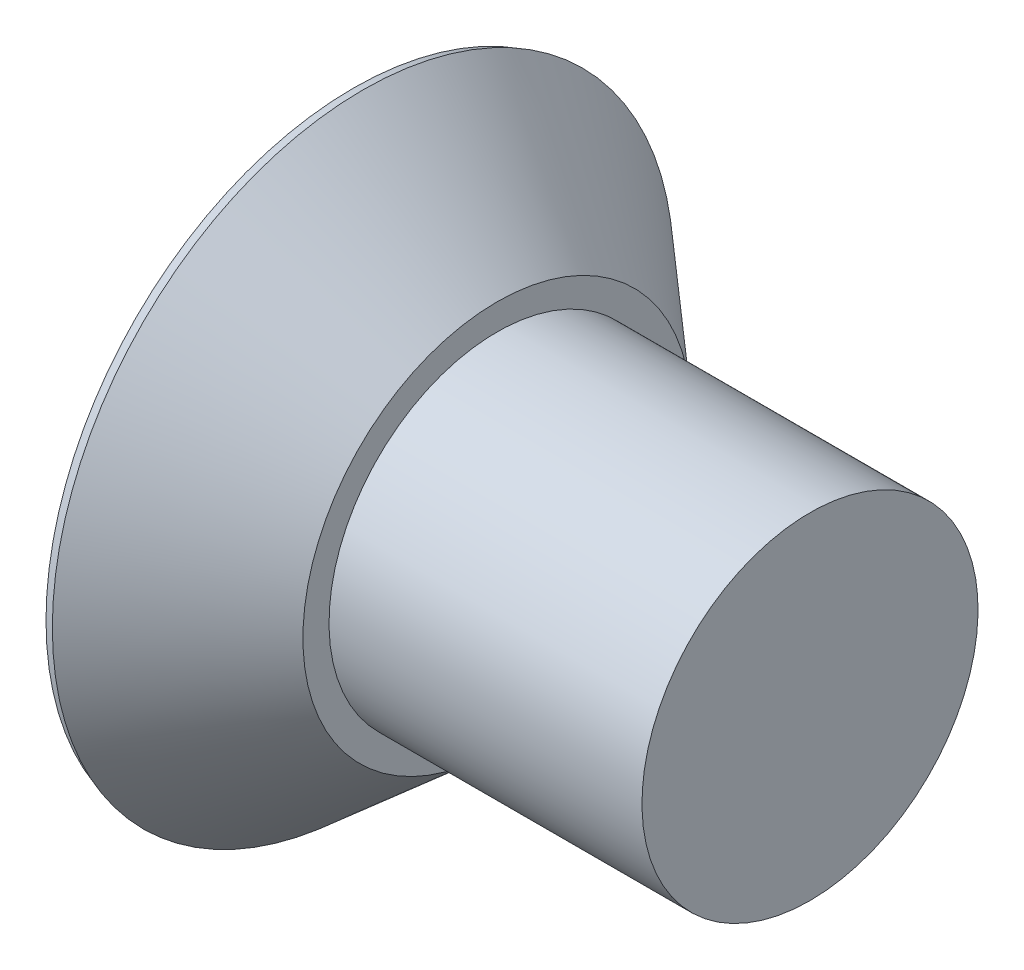
ISO-10303-21;
HEADER;
FILE_DESCRIPTION(('STEP AP214'),'2;1');
FILE_NAME('part.step','',(''),(''),'','','');
FILE_SCHEMA(('AUTOMOTIVE_DESIGN { 1 0 10303 214 1 1 1 1 }'));
ENDSEC;
DATA;
#1=APPLICATION_CONTEXT('core data for automotive mechanical design processes');
#2=APPLICATION_PROTOCOL_DEFINITION('international standard','automotive_design',2000,#1);
#3=PRODUCT_CONTEXT('',#1,'mechanical');
#4=PRODUCT('Part','Part','',(#3));
#5=PRODUCT_RELATED_PRODUCT_CATEGORY('part','',(#4));
#6=PRODUCT_DEFINITION_FORMATION('','',#4);
#7=PRODUCT_DEFINITION_CONTEXT('part definition',#1,'design');
#8=PRODUCT_DEFINITION('design','',#6,#7);
#9=PRODUCT_DEFINITION_SHAPE('','',#8);
#10=(LENGTH_UNIT() NAMED_UNIT(*) SI_UNIT(.MILLI.,.METRE.));
#11=(NAMED_UNIT(*) PLANE_ANGLE_UNIT() SI_UNIT($,.RADIAN.));
#12=(NAMED_UNIT(*) SI_UNIT($,.STERADIAN.) SOLID_ANGLE_UNIT());
#13=UNCERTAINTY_MEASURE_WITH_UNIT(LENGTH_MEASURE(1.E-05),#10,'distance_accuracy_value','');
#14=(GEOMETRIC_REPRESENTATION_CONTEXT(3) GLOBAL_UNCERTAINTY_ASSIGNED_CONTEXT((#13)) GLOBAL_UNIT_ASSIGNED_CONTEXT((#10,
#11,#12)) REPRESENTATION_CONTEXT('',''));
#15=CARTESIAN_POINT('',(0.,0.,0.));
#16=DIRECTION('',(0.,0.,1.));
#17=DIRECTION('',(1.,0.,0.));
#18=AXIS2_PLACEMENT_3D('',#15,#16,#17);
#19=CARTESIAN_POINT('',(-2.38125,0.,0.));
#20=DIRECTION('',(1.,0.,0.));
#21=DIRECTION('',(0.,1.,0.));
#22=AXIS2_PLACEMENT_3D('',#19,#20,#21);
#23=PLANE('',#22);
#24=CARTESIAN_POINT('',(-2.38125,0.,0.));
#25=DIRECTION('',(1.,0.,0.));
#26=DIRECTION('',(0.,1.,0.));
#27=AXIS2_PLACEMENT_3D('',#24,#25,#26);
#28=CIRCLE('',#27,3.20549386286353);
#29=CARTESIAN_POINT('',(-2.38125,3.20549386286353,0.));
#30=VERTEX_POINT('',#29);
#31=EDGE_CURVE('E51',#30,#30,#28,.F.);
#32=ORIENTED_EDGE('',*,*,#31,.T.);
#33=EDGE_LOOP('',(#32));
#34=FACE_BOUND('',#33,.T.);
#35=CARTESIAN_POINT('',(-2.38125,0.,0.));
#36=DIRECTION('',(-1.,0.,0.));
#37=DIRECTION('',(0.,-1.,0.));
#38=AXIS2_PLACEMENT_3D('',#35,#36,#37);
#39=CIRCLE('',#38,1.85778392197704);
#40=CARTESIAN_POINT('',(-2.38125,0.443653333333335,1.80403237791859));
#41=VERTEX_POINT('',#40);
#42=CARTESIAN_POINT('',(-2.38125,-0.443653333333341,1.80403237791859));
#43=VERTEX_POINT('',#42);
#44=EDGE_CURVE('E258',#41,#43,#39,.F.);
#45=ORIENTED_EDGE('',*,*,#44,.T.);
#46=DIRECTION('',(0.,0.,1.));
#47=VECTOR('',#46,1.);
#48=CARTESIAN_POINT('',(-2.38125,-0.443653333333342,2.17344857870313));
#49=LINE('',#48,#47);
#50=CARTESIAN_POINT('',(-2.38125,-0.443653333333339,1.30855095601823));
#51=VERTEX_POINT('',#50);
#52=EDGE_CURVE('E226',#51,#43,#49,.T.);
#53=ORIENTED_EDGE('',*,*,#52,.F.);
#54=DIRECTION('',(0.,0.382683432365087,0.923879532511288));
#55=VECTOR('',#54,1.);
#56=CARTESIAN_POINT('',(-2.38125,-0.443653333333339,1.30855095601823));
#57=LINE('',#56,#55);
#58=CARTESIAN_POINT('',(-2.38125,-0.696975981985619,0.696975981985617));
#59=VERTEX_POINT('',#58);
#60=EDGE_CURVE('E221',#59,#51,#57,.T.);
#61=ORIENTED_EDGE('',*,*,#60,.F.);
#62=DIRECTION('',(0.,0.923879532511285,0.382683432365093));
#63=VECTOR('',#62,1.);
#64=CARTESIAN_POINT('',(-2.38125,-0.696975981985619,0.696975981985617));
#65=LINE('',#64,#63);
#66=CARTESIAN_POINT('',(-2.38125,-1.30855095601823,0.443653333333331));
#67=VERTEX_POINT('',#66);
#68=EDGE_CURVE('E234',#67,#59,#65,.T.);
#69=ORIENTED_EDGE('',*,*,#68,.F.);
#70=DIRECTION('',(0.,1.,0.));
#71=VECTOR('',#70,1.);
#72=CARTESIAN_POINT('',(-2.38125,-1.30855095601823,0.443653333333331));
#73=LINE('',#72,#71);
#74=CARTESIAN_POINT('',(-2.38125,-1.80403237791859,0.44365333333333));
#75=VERTEX_POINT('',#74);
#76=EDGE_CURVE('E230',#75,#67,#73,.T.);
#77=ORIENTED_EDGE('',*,*,#76,.F.);
#78=CARTESIAN_POINT('',(-2.38125,0.,0.));
#79=DIRECTION('',(-1.,0.,0.));
#80=DIRECTION('',(0.,-1.,0.));
#81=AXIS2_PLACEMENT_3D('',#78,#79,#80);
#82=CIRCLE('',#81,1.85778392197704);
#83=CARTESIAN_POINT('',(-2.38125,-1.8040323779186,-0.443653333333334));
#84=VERTEX_POINT('',#83);
#85=EDGE_CURVE('E239',#75,#84,#82,.F.);
#86=ORIENTED_EDGE('',*,*,#85,.T.);
#87=DIRECTION('',(0.,-1.,0.));
#88=VECTOR('',#87,1.);
#89=CARTESIAN_POINT('',(-2.38125,-2.17344857870313,-0.443653333333334));
#90=LINE('',#89,#88);
#91=CARTESIAN_POINT('',(-2.38125,-1.30855095601823,-0.443653333333334));
#92=VERTEX_POINT('',#91);
#93=EDGE_CURVE('E205',#92,#84,#90,.T.);
#94=ORIENTED_EDGE('',*,*,#93,.F.);
#95=DIRECTION('',(0.,-0.923879532511287,0.38268343236509));
#96=VECTOR('',#95,1.);
#97=CARTESIAN_POINT('',(-2.38125,-1.30855095601823,-0.443653333333334));
#98=LINE('',#97,#96);
#99=CARTESIAN_POINT('',(-2.38125,-0.69697598198562,-0.696975981985617));
#100=VERTEX_POINT('',#99);
#101=EDGE_CURVE('E201',#100,#92,#98,.T.);
#102=ORIENTED_EDGE('',*,*,#101,.F.);
#103=DIRECTION('',(0.,-0.38268343236509,0.923879532511287));
#104=VECTOR('',#103,1.);
#105=CARTESIAN_POINT('',(-2.38125,-0.69697598198562,-0.696975981985617));
#106=LINE('',#105,#104);
#107=CARTESIAN_POINT('',(-2.38125,-0.443653333333336,-1.30855095601823));
#108=VERTEX_POINT('',#107);
#109=EDGE_CURVE('E214',#108,#100,#106,.T.);
#110=ORIENTED_EDGE('',*,*,#109,.F.);
#111=DIRECTION('',(0.,0.,1.));
#112=VECTOR('',#111,1.);
#113=CARTESIAN_POINT('',(-2.38125,-0.443653333333336,-1.30855095601823));
#114=LINE('',#113,#112);
#115=CARTESIAN_POINT('',(-2.38125,-0.443653333333336,-1.80403237791859));
#116=VERTEX_POINT('',#115);
#117=EDGE_CURVE('E210',#116,#108,#114,.T.);
#118=ORIENTED_EDGE('',*,*,#117,.F.);
#119=CARTESIAN_POINT('',(-2.38125,0.,0.));
#120=DIRECTION('',(-1.,0.,0.));
#121=DIRECTION('',(0.,-1.,0.));
#122=AXIS2_PLACEMENT_3D('',#119,#120,#121);
#123=CIRCLE('',#122,1.85778392197704);
#124=CARTESIAN_POINT('',(-2.38125,0.443653333333353,-1.80403237791859));
#125=VERTEX_POINT('',#124);
#126=EDGE_CURVE('E191',#116,#125,#123,.F.);
#127=ORIENTED_EDGE('',*,*,#126,.T.);
#128=DIRECTION('',(0.,0.,-1.));
#129=VECTOR('',#128,1.);
#130=CARTESIAN_POINT('',(-2.38125,0.443653333333356,-2.17344857870313));
#131=LINE('',#130,#129);
#132=CARTESIAN_POINT('',(-2.38125,0.443653333333347,-1.30855095601823));
#133=VERTEX_POINT('',#132);
#134=EDGE_CURVE('E170',#133,#125,#131,.T.);
#135=ORIENTED_EDGE('',*,*,#134,.F.);
#136=DIRECTION('',(0.,-0.38268343236508,-0.923879532511291));
#137=VECTOR('',#136,1.);
#138=CARTESIAN_POINT('',(-2.38125,0.443653333333347,-1.30855095601823));
#139=LINE('',#138,#137);
#140=CARTESIAN_POINT('',(-2.38125,0.696975981985623,-0.696975981985612));
#141=VERTEX_POINT('',#140);
#142=EDGE_CURVE('E180',#141,#133,#139,.T.);
#143=ORIENTED_EDGE('',*,*,#142,.F.);
#144=DIRECTION('',(0.,-0.923879532511283,-0.3826834323651));
#145=VECTOR('',#144,1.);
#146=CARTESIAN_POINT('',(-2.38125,0.696975981985623,-0.696975981985612));
#147=LINE('',#146,#145);
#148=CARTESIAN_POINT('',(-2.38125,1.30855095601824,-0.443653333333322));
#149=VERTEX_POINT('',#148);
#150=EDGE_CURVE('E177',#149,#141,#147,.T.);
#151=ORIENTED_EDGE('',*,*,#150,.F.);
#152=DIRECTION('',(0.,-1.,0.));
#153=VECTOR('',#152,1.);
#154=CARTESIAN_POINT('',(-2.38125,1.30855095601824,-0.443653333333322));
#155=LINE('',#154,#153);
#156=CARTESIAN_POINT('',(-2.38125,1.8040323779186,-0.443653333333317));
#157=VERTEX_POINT('',#156);
#158=EDGE_CURVE('E193',#157,#149,#155,.T.);
#159=ORIENTED_EDGE('',*,*,#158,.F.);
#160=CARTESIAN_POINT('',(-2.38125,1.80403237791859,0.443653333333334));
#161=VERTEX_POINT('',#160);
#162=EDGE_CURVE('E262',#157,#161,#39,.F.);
#163=ORIENTED_EDGE('',*,*,#162,.T.);
#164=DIRECTION('',(0.,1.,0.));
#165=VECTOR('',#164,1.);
#166=CARTESIAN_POINT('',(-2.38125,2.17344857870313,0.443653333333334));
#167=LINE('',#166,#165);
#168=CARTESIAN_POINT('',(-2.38125,1.30855095601823,0.443653333333334));
#169=VERTEX_POINT('',#168);
#170=EDGE_CURVE('E59',#169,#161,#167,.T.);
#171=ORIENTED_EDGE('',*,*,#170,.F.);
#172=DIRECTION('',(0.,0.923879532511287,-0.38268343236509));
#173=VECTOR('',#172,1.);
#174=CARTESIAN_POINT('',(-2.38125,1.30855095601823,0.443653333333334));
#175=LINE('',#174,#173);
#176=CARTESIAN_POINT('',(-2.38125,0.696975981985619,0.696975981985617));
#177=VERTEX_POINT('',#176);
#178=EDGE_CURVE('E243',#177,#169,#175,.T.);
#179=ORIENTED_EDGE('',*,*,#178,.F.);
#180=DIRECTION('',(0.,0.38268343236509,-0.923879532511287));
#181=VECTOR('',#180,1.);
#182=CARTESIAN_POINT('',(-2.38125,0.696975981985619,0.696975981985617));
#183=LINE('',#182,#181);
#184=CARTESIAN_POINT('',(-2.38125,0.443653333333335,1.30855095601823));
#185=VERTEX_POINT('',#184);
#186=EDGE_CURVE('E253',#185,#177,#183,.T.);
#187=ORIENTED_EDGE('',*,*,#186,.F.);
#188=DIRECTION('',(0.,0.,-1.));
#189=VECTOR('',#188,1.);
#190=CARTESIAN_POINT('',(-2.38125,0.443653333333335,1.30855095601823));
#191=LINE('',#190,#189);
#192=EDGE_CURVE('E250',#41,#185,#191,.T.);
#193=ORIENTED_EDGE('',*,*,#192,.F.);
#194=EDGE_LOOP('',(#45,#53,#61,#69,#77,#86,#94,#102,#110,#118,#127,#135,#143,#151,#159,#163,
#171,#179,#187,#193));
#195=FACE_BOUND('',#194,.T.);
#196=ADVANCED_FACE('F41',(#34,#195),#23,.F.);
#197=CARTESIAN_POINT('',(2.38125,0.,0.));
#198=DIRECTION('',(-1.,0.,0.));
#199=DIRECTION('',(0.,-1.,0.));
#200=AXIS2_PLACEMENT_3D('',#197,#198,#199);
#201=PLANE('',#200);
#202=CARTESIAN_POINT('',(2.38125,0.,0.));
#203=DIRECTION('',(-1.,0.,0.));
#204=DIRECTION('',(0.,-1.,0.));
#205=AXIS2_PLACEMENT_3D('',#202,#203,#204);
#206=CIRCLE('',#205,1.7526);
#207=CARTESIAN_POINT('',(2.38125,-1.7526,0.));
#208=VERTEX_POINT('',#207);
#209=EDGE_CURVE('E270',#208,#208,#206,.T.);
#210=ORIENTED_EDGE('',*,*,#209,.F.);
#211=EDGE_LOOP('',(#210));
#212=FACE_BOUND('',#211,.T.);
#213=ADVANCED_FACE('F427',(#212),#201,.F.);
#214=CARTESIAN_POINT('',(-2.38125,0.,0.));
#215=DIRECTION('',(-1.,0.,0.));
#216=DIRECTION('',(0.,-1.,0.));
#217=AXIS2_PLACEMENT_3D('',#214,#215,#216);
#218=CYLINDRICAL_SURFACE('',#217,1.7526);
#219=CARTESIAN_POINT('',(-0.88265,0.,0.));
#220=DIRECTION('',(-1.,0.,0.));
#221=DIRECTION('',(0.,-1.,0.));
#222=AXIS2_PLACEMENT_3D('',#219,#220,#221);
#223=CIRCLE('',#222,1.7526);
#224=CARTESIAN_POINT('',(-0.88265,-1.7526,0.));
#225=VERTEX_POINT('',#224);
#226=EDGE_CURVE('E266',#225,#225,#223,.T.);
#227=ORIENTED_EDGE('',*,*,#226,.F.);
#228=EDGE_LOOP('',(#227));
#229=FACE_BOUND('',#228,.T.);
#230=ORIENTED_EDGE('',*,*,#209,.T.);
#231=EDGE_LOOP('',(#230));
#232=FACE_BOUND('',#231,.T.);
#233=ADVANCED_FACE('F432',(#229,#232),#218,.T.);
#234=CARTESIAN_POINT('',(-0.88265,1.7526,0.));
#235=DIRECTION('',(-1.,0.,0.));
#236=DIRECTION('',(0.,-1.,0.));
#237=AXIS2_PLACEMENT_3D('',#234,#235,#236);
#238=PLANE('',#237);
#239=CARTESIAN_POINT('',(-0.88265,0.,0.));
#240=DIRECTION('',(-1.,0.,0.));
#241=DIRECTION('',(0.,-1.,0.));
#242=AXIS2_PLACEMENT_3D('',#239,#240,#241);
#243=CIRCLE('',#242,2.0246868947086);
#244=CARTESIAN_POINT('',(-0.882649999999999,-2.0246868947086,0.));
#245=VERTEX_POINT('',#244);
#246=EDGE_CURVE('E261',#245,#245,#243,.T.);
#247=ORIENTED_EDGE('',*,*,#246,.F.);
#248=EDGE_LOOP('',(#247));
#249=FACE_BOUND('',#248,.T.);
#250=ORIENTED_EDGE('',*,*,#226,.T.);
#251=EDGE_LOOP('',(#250));
#252=FACE_BOUND('',#251,.T.);
#253=ADVANCED_FACE('F438',(#249,#252),#238,.F.);
#254=CARTESIAN_POINT('',(-0.88265,0.,0.));
#255=DIRECTION('',(-1.,0.,0.));
#256=DIRECTION('',(0.,-1.,0.));
#257=AXIS2_PLACEMENT_3D('',#254,#255,#256);
#258=CONICAL_SURFACE('',#257,2.0246868947086,0.715584993317677);
#259=CARTESIAN_POINT('',(-2.28080117371067,0.,0.));
#260=DIRECTION('',(1.,0.,0.));
#261=DIRECTION('',(0.,1.,0.));
#262=AXIS2_PLACEMENT_3D('',#259,#260,#261);
#263=CIRCLE('',#262,3.24008116747748);
#264=CARTESIAN_POINT('',(-2.28080117371067,3.24008116747748,0.));
#265=VERTEX_POINT('',#264);
#266=EDGE_CURVE('E12',#265,#265,#263,.T.);
#267=ORIENTED_EDGE('',*,*,#266,.T.);
#268=EDGE_LOOP('',(#267));
#269=FACE_BOUND('',#268,.T.);
#270=ORIENTED_EDGE('',*,*,#246,.T.);
#271=EDGE_LOOP('',(#270));
#272=FACE_BOUND('',#271,.T.);
#273=ADVANCED_FACE('F302',(#269,#272),#258,.T.);
#274=CARTESIAN_POINT('',(-2.38125,2.17344857870313,0.443653333333334));
#275=DIRECTION('',(-0.0871557427476584,0.,-0.996194698091745));
#276=DIRECTION('',(-0.996194698091746,0.,0.0871557427476584));
#277=AXIS2_PLACEMENT_3D('',#274,#275,#276);
#278=PLANE('',#277);
#279=CARTESIAN_POINT('',(-2.38125,1.80403237791859,0.443653333333334));
#280=CARTESIAN_POINT('',(-2.33313916956716,1.7619985798292,0.439444181077642));
#281=CARTESIAN_POINT('',(-2.28504214926996,1.7199488396603,0.435236237052261));
#282=CARTESIAN_POINT('',(-2.18888443628984,1.63580765051655,0.426823527255921));
#283=CARTESIAN_POINT('',(-2.14082374356158,1.5937162015939,0.422618761480996));
#284=CARTESIAN_POINT('',(-2.04474724700092,1.5094816426922,0.41421315720065));
#285=CARTESIAN_POINT('',(-1.99673144319259,1.46733853268545,0.410012318697336));
#286=CARTESIAN_POINT('',(-1.90075889584453,1.38298448864911,0.401615808794676));
#287=CARTESIAN_POINT('',(-1.85280215237926,1.34077355453414,0.397420137401845));
#288=CARTESIAN_POINT('',(-1.80488207237906,1.29852066867325,0.393227673646571));
#289=B_SPLINE_CURVE_WITH_KNOTS('',3,(#279,#280,#281,#282,#283,#284,#285,#286,#287,#288),
.UNSPECIFIED.,.F.,.F.,(4,2,2,2,4),(0.,0.192075209228686,0.384150178394845,0.576225250546724,
0.768300564644841),.UNSPECIFIED.);
#290=CARTESIAN_POINT('',(-1.80488207237904,1.29852066867326,0.39322767364657));
#291=VERTEX_POINT('',#290);
#292=EDGE_CURVE('E109',#161,#291,#289,.T.);
#293=ORIENTED_EDGE('',*,*,#292,.T.);
#294=DIRECTION('',(-0.996045029063886,0.0173337504938601,0.0871426484044397));
#295=VECTOR('',#294,1.);
#296=CARTESIAN_POINT('',(-2.39618262698808,1.30881082221191,0.444959768911452));
#297=LINE('',#296,#295);
#298=EDGE_CURVE('E257',#291,#169,#297,.T.);
#299=ORIENTED_EDGE('',*,*,#298,.T.);
#300=ORIENTED_EDGE('',*,*,#170,.T.);
#301=EDGE_LOOP('',(#293,#299,#300));
#302=FACE_BOUND('',#301,.T.);
#303=ADVANCED_FACE('F445',(#302),#278,.T.);
#304=CARTESIAN_POINT('',(-2.38125,0.443653333333335,1.30855095601823));
#305=DIRECTION('',(-0.0871557427476582,-0.996194698091745,0.));
#306=DIRECTION('',(0.996194698091746,-0.0871557427476582,0.));
#307=AXIS2_PLACEMENT_3D('',#304,#305,#306);
#308=PLANE('',#307);
#309=CARTESIAN_POINT('',(-1.80488207237904,0.393227673646572,1.29852066867326));
#310=CARTESIAN_POINT('',(-1.85280215237926,0.397420137401846,1.34077355453414));
#311=CARTESIAN_POINT('',(-1.90075889584452,0.401615808794677,1.38298448864911));
#312=CARTESIAN_POINT('',(-1.99673144319259,0.410012318697338,1.46733853268545));
#313=CARTESIAN_POINT('',(-2.04474724700092,0.414213157200652,1.5094816426922));
#314=CARTESIAN_POINT('',(-2.14082374356158,0.422618761480997,1.5937162015939));
#315=CARTESIAN_POINT('',(-2.18888443628984,0.426823527255922,1.63580765051655));
#316=CARTESIAN_POINT('',(-2.28504214926996,0.435236237052263,1.7199488396603));
#317=CARTESIAN_POINT('',(-2.33313916956716,0.439444181077644,1.7619985798292));
#318=CARTESIAN_POINT('',(-2.38125,0.443653333333335,1.80403237791859));
#319=B_SPLINE_CURVE_WITH_KNOTS('',3,(#309,#310,#311,#312,#313,#314,#315,#316,#317,#318),
.UNSPECIFIED.,.F.,.F.,(4,2,2,2,4),(0.,0.192075314098117,0.384150386249995,0.576225355416153,
0.76830056464484),.UNSPECIFIED.);
#320=CARTESIAN_POINT('',(-1.80488207237904,0.393227673646572,1.29852066867326));
#321=VERTEX_POINT('',#320);
#322=EDGE_CURVE('E116',#321,#41,#319,.T.);
#323=ORIENTED_EDGE('',*,*,#322,.T.);
#324=ORIENTED_EDGE('',*,*,#192,.T.);
#325=DIRECTION('',(-0.996045029063886,0.0871426484044395,0.0173337504938603));
#326=VECTOR('',#325,1.);
#327=CARTESIAN_POINT('',(-2.39267893790005,0.444653235835732,1.30874984899213));
#328=LINE('',#327,#326);
#329=EDGE_CURVE('E470',#321,#185,#328,.T.);
#330=ORIENTED_EDGE('',*,*,#329,.F.);
#331=EDGE_LOOP('',(#323,#324,#330));
#332=FACE_BOUND('',#331,.T.);
#333=ADVANCED_FACE('F419',(#332),#308,.T.);
#334=CARTESIAN_POINT('',(-2.38125,0.696975981985619,0.696975981985617));
#335=DIRECTION('',(-0.0871557427476582,-0.920363891963224,-0.381227206369654));
#336=DIRECTION('',(0.,0.38268343236509,-0.923879532511287));
#337=AXIS2_PLACEMENT_3D('',#334,#335,#336);
#338=PLANE('',#337);
#339=CARTESIAN_POINT('',(-1.25534935097126,0.621584634079309,0.621584634079307));
#340=CARTESIAN_POINT('',(-1.26864027946566,0.612197965955895,0.647284612957172));
#341=CARTESIAN_POINT('',(-1.28295666683925,0.603099671025228,0.672522836638136));
#342=CARTESIAN_POINT('',(-1.31319848549949,0.585406530250408,0.722151708229198));
#343=CARTESIAN_POINT('',(-1.32912163779573,0.576810997911969,0.746543492462847));
#344=CARTESIAN_POINT('',(-1.36211628152607,0.560053947740962,0.794541789248833));
#345=CARTESIAN_POINT('',(-1.37918351831562,0.551891004178205,0.818150771126196));
#346=CARTESIAN_POINT('',(-1.4142535356775,0.535893319850772,0.864790266220632));
#347=CARTESIAN_POINT('',(-1.43225668656817,0.528058711249064,0.887820545029844));
#348=CARTESIAN_POINT('',(-1.48712795244717,0.505050272578142,0.955912437902741));
#349=CARTESIAN_POINT('',(-1.525055612449,0.490275615307991,1.00025259559162));
#350=CARTESIAN_POINT('',(-1.60273336824755,0.461453442775634,1.08759407813004));
#351=CARTESIAN_POINT('',(-1.6424849129971,0.447406525195917,1.13059429130442));
#352=CARTESIAN_POINT('',(-1.70290200004715,0.426777152333373,1.19421049074616));
#353=CARTESIAN_POINT('',(-1.72310646147017,0.419995294273181,1.21520246610219));
#354=CARTESIAN_POINT('',(-1.76379905628938,0.406535553796763,1.25700025017755));
#355=CARTESIAN_POINT('',(-1.78428752785224,0.399857819876078,1.27780577770821));
#356=CARTESIAN_POINT('',(-1.80488207237905,0.393227673646574,1.29852066867325));
#357=B_SPLINE_CURVE_WITH_KNOTS('',3,(#339,#340,#341,#342,#343,#344,#345,#346,#347,#348,#349,
#350,#351,#352,#353,#354,#355,#356),.UNSPECIFIED.,.F.,.F.,(4,2,2,2,2,2,2,2,4),(0.,
0.0911869021173685,0.182246238297853,0.272983947920126,0.363757837626611,0.544245502786659,
0.724879123559479,0.814620849754082,0.904480615943712),.UNSPECIFIED.);
#358=CARTESIAN_POINT('',(-1.25534935097126,0.621584634079309,0.621584634079307));
#359=VERTEX_POINT('',#358);
#360=EDGE_CURVE('E405',#359,#321,#357,.T.);
#361=ORIENTED_EDGE('',*,*,#360,.T.);
#362=ORIENTED_EDGE('',*,*,#329,.T.);
#363=ORIENTED_EDGE('',*,*,#186,.T.);
#364=DIRECTION('',(-0.995546167269401,0.0666626913468322,0.0666626913468324));
#365=VECTOR('',#364,1.);
#366=CARTESIAN_POINT('',(-2.40502569747195,0.698568024659516,0.698568024659514));
#367=LINE('',#366,#365);
#368=EDGE_CURVE('E468',#359,#177,#367,.T.);
#369=ORIENTED_EDGE('',*,*,#368,.F.);
#370=EDGE_LOOP('',(#361,#362,#363,#369));
#371=FACE_BOUND('',#370,.T.);
#372=ADVANCED_FACE('F416',(#371),#338,.T.);
#373=CARTESIAN_POINT('',(-2.38125,1.30855095601823,0.443653333333334));
#374=DIRECTION('',(-0.0871557427476583,-0.381227206369654,-0.920363891963224));
#375=DIRECTION('',(0.,0.923879532511287,-0.38268343236509));
#376=AXIS2_PLACEMENT_3D('',#373,#374,#375);
#377=PLANE('',#376);
#378=CARTESIAN_POINT('',(-1.80488207237904,1.29852066867326,0.39322767364657));
#379=CARTESIAN_POINT('',(-1.77895667255378,1.27244326082035,0.401574230844656));
#380=CARTESIAN_POINT('',(-1.75320017097531,1.24622416392674,0.409995471730261));
#381=CARTESIAN_POINT('',(-1.70211577912161,1.19343325829183,0.427024639757123));
#382=CARTESIAN_POINT('',(-1.67678787788688,1.16686145860041,0.435632562111966));
#383=CARTESIAN_POINT('',(-1.60182530143728,1.08677168051612,0.461708099775561));
#384=CARTESIAN_POINT('',(-1.55295769922927,1.03262686229013,0.479508000193212));
#385=CARTESIAN_POINT('',(-1.48218293428302,0.949415182976467,0.507273245069221));
#386=CARTESIAN_POINT('',(-1.45897093161794,0.92129041858178,0.516724795812373));
#387=CARTESIAN_POINT('',(-1.4137548162684,0.864257040033871,0.536066962113809));
#388=CARTESIAN_POINT('',(-1.39174999556238,0.835348900528016,0.545957314019165));
#389=CARTESIAN_POINT('',(-1.34924989088138,0.776397684482621,0.566351072812457));
#390=CARTESIAN_POINT('',(-1.328762484902,0.746349764101839,0.576857232108051));
#391=CARTESIAN_POINT('',(-1.29011103816214,0.684971498363006,0.598620764342913));
#392=CARTESIAN_POINT('',(-1.27195192778003,0.653638611167803,0.609879657037876));
#393=CARTESIAN_POINT('',(-1.25534935097069,0.621584634079796,0.621584634079051));
#394=B_SPLINE_CURVE_WITH_KNOTS('',3,(#378,#379,#380,#381,#382,#383,#384,#385,#386,#387,#388,
#389,#390,#391,#392,#393),.UNSPECIFIED.,.F.,.F.,(4,2,2,2,2,2,2,4),(0.,0.113116282910397,
0.226229669000348,0.45135551516347,0.564346939613073,0.67727136921621,0.790746046408614,
0.904457181617426),.UNSPECIFIED.);
#395=EDGE_CURVE('E106',#291,#359,#394,.T.);
#396=ORIENTED_EDGE('',*,*,#395,.T.);
#397=ORIENTED_EDGE('',*,*,#368,.T.);
#398=ORIENTED_EDGE('',*,*,#178,.T.);
#399=ORIENTED_EDGE('',*,*,#298,.F.);
#400=EDGE_LOOP('',(#396,#397,#398,#399));
#401=FACE_BOUND('',#400,.T.);
#402=ADVANCED_FACE('F300',(#401),#377,.T.);
#403=CARTESIAN_POINT('',(-1.61030693768768,0.,0.));
#404=DIRECTION('',(-1.,0.,0.));
#405=DIRECTION('',(0.,-1.,0.));
#406=AXIS2_PLACEMENT_3D('',#403,#404,#405);
#407=CONICAL_SURFACE('',#406,1.18761334229751,0.715584993317677);
#408=CARTESIAN_POINT('',(-0.24411406871448,0.,0.));
#409=VERTEX_POINT('',#408);
#410=VERTEX_LOOP('',#409);
#411=FACE_BOUND('',#410,.T.);
#412=ORIENTED_EDGE('',*,*,#162,.F.);
#413=CARTESIAN_POINT('',(-1.80488207237904,1.29852066867326,-0.393227673646558));
#414=CARTESIAN_POINT('',(-1.85280215237926,1.34077355453414,-0.397420137401832));
#415=CARTESIAN_POINT('',(-1.90075889584453,1.38298448864911,-0.401615808794663));
#416=CARTESIAN_POINT('',(-1.99673144319259,1.46733853268546,-0.410012318697323));
#417=CARTESIAN_POINT('',(-2.04474724700092,1.5094816426922,-0.414213157200636));
#418=CARTESIAN_POINT('',(-2.14082374356158,1.5937162015939,-0.422618761480981));
#419=CARTESIAN_POINT('',(-2.18888443628984,1.63580765051655,-0.426823527255906));
#420=CARTESIAN_POINT('',(-2.28504214926996,1.7199488396603,-0.435236237052245));
#421=CARTESIAN_POINT('',(-2.33313916956716,1.7619985798292,-0.439444181077626));
#422=CARTESIAN_POINT('',(-2.38125,1.8040323779186,-0.443653333333317));
#423=B_SPLINE_CURVE_WITH_KNOTS('',3,(#413,#414,#415,#416,#417,#418,#419,#420,#421,#422),
.UNSPECIFIED.,.F.,.F.,(4,2,2,2,4),(0.,0.192075314098117,0.384150386249995,0.576225355416154,
0.768300564644841),.UNSPECIFIED.);
#424=CARTESIAN_POINT('',(-1.80488207237904,1.29852066867326,-0.393227673646558));
#425=VERTEX_POINT('',#424);
#426=EDGE_CURVE('E286',#425,#157,#423,.T.);
#427=ORIENTED_EDGE('',*,*,#426,.F.);
#428=CARTESIAN_POINT('',(-1.25534935097126,0.621584634079313,-0.621584634079303));
#429=CARTESIAN_POINT('',(-1.26864027946566,0.647284612957178,-0.612197965955888));
#430=CARTESIAN_POINT('',(-1.28295666683925,0.672522836638142,-0.603099671025221));
#431=CARTESIAN_POINT('',(-1.31319848549949,0.722151708229204,-0.585406530250401));
#432=CARTESIAN_POINT('',(-1.32912163779573,0.746543492462853,-0.576810997911961));
#433=CARTESIAN_POINT('',(-1.36211628152607,0.794541789248839,-0.560053947740954));
#434=CARTESIAN_POINT('',(-1.37918351831562,0.818150771126202,-0.551891004178196));
#435=CARTESIAN_POINT('',(-1.4142535356775,0.864790266220637,-0.535893319850764));
#436=CARTESIAN_POINT('',(-1.43225668656817,0.88782054502985,-0.528058711249055));
#437=CARTESIAN_POINT('',(-1.48712795244717,0.955912437902745,-0.505050272578132));
#438=CARTESIAN_POINT('',(-1.525055612449,1.00025259559162,-0.49027561530798));
#439=CARTESIAN_POINT('',(-1.60273336824755,1.08759407813005,-0.461453442775623));
#440=CARTESIAN_POINT('',(-1.6424849129971,1.13059429130443,-0.447406525195906));
#441=CARTESIAN_POINT('',(-1.70290200004715,1.19421049074617,-0.42677715233336));
#442=CARTESIAN_POINT('',(-1.72310646147017,1.2152024661022,-0.419995294273169));
#443=CARTESIAN_POINT('',(-1.76379905628938,1.25700025017755,-0.40653555379675));
#444=CARTESIAN_POINT('',(-1.78428752785224,1.27780577770822,-0.399857819876065));
#445=CARTESIAN_POINT('',(-1.80488207237905,1.29852066867326,-0.393227673646561));
#446=B_SPLINE_CURVE_WITH_KNOTS('',3,(#428,#429,#430,#431,#432,#433,#434,#435,#436,#437,#438,
#439,#440,#441,#442,#443,#444,#445),.UNSPECIFIED.,.F.,.F.,(4,2,2,2,2,2,2,2,4),(0.,
0.0911869021173685,0.182246238297853,0.272983947920126,0.363757837626611,0.544245502786659,
0.724879123559478,0.814620849754081,0.904480615943712),.UNSPECIFIED.);
#447=CARTESIAN_POINT('',(-1.25534935097126,0.621584634079313,-0.621584634079303));
#448=VERTEX_POINT('',#447);
#449=EDGE_CURVE('E319',#448,#425,#446,.T.);
#450=ORIENTED_EDGE('',*,*,#449,.F.);
#451=CARTESIAN_POINT('',(-1.80488207237905,0.393227673646583,-1.29852066867325));
#452=CARTESIAN_POINT('',(-1.77895667255379,0.401574230844669,-1.27244326082035));
#453=CARTESIAN_POINT('',(-1.75320017097531,0.409995471730274,-1.24622416392673));
#454=CARTESIAN_POINT('',(-1.70211577912161,0.427024639757135,-1.19343325829183));
#455=CARTESIAN_POINT('',(-1.67678787788688,0.435632562111978,-1.16686145860041));
#456=CARTESIAN_POINT('',(-1.60182530143728,0.461708099775572,-1.08677168051611));
#457=CARTESIAN_POINT('',(-1.55295769922927,0.479508000193223,-1.03262686229013));
#458=CARTESIAN_POINT('',(-1.48218293428302,0.50727324506923,-0.949415182976463));
#459=CARTESIAN_POINT('',(-1.45897093161794,0.516724795812383,-0.921290418581775));
#460=CARTESIAN_POINT('',(-1.4137548162684,0.536066962113817,-0.864257040033866));
#461=CARTESIAN_POINT('',(-1.39174999556238,0.545957314019174,-0.835348900528011));
#462=CARTESIAN_POINT('',(-1.34924989088138,0.566351072812465,-0.776397684482615));
#463=CARTESIAN_POINT('',(-1.328762484902,0.576857232108059,-0.746349764101833));
#464=CARTESIAN_POINT('',(-1.29011103816214,0.598620764342921,-0.684971498363));
#465=CARTESIAN_POINT('',(-1.27195192778003,0.609879657037883,-0.653638611167797));
#466=CARTESIAN_POINT('',(-1.25534935097069,0.621584634079057,-0.62158463407979));
#467=B_SPLINE_CURVE_WITH_KNOTS('',3,(#451,#452,#453,#454,#455,#456,#457,#458,#459,#460,#461,
#462,#463,#464,#465,#466),.UNSPECIFIED.,.F.,.F.,(4,2,2,2,2,2,2,4),(0.,0.113116282910397,
0.226229669000348,0.45135551516347,0.564346939613073,0.677271369216211,0.790746046408615,
0.904457181617427),.UNSPECIFIED.);
#468=CARTESIAN_POINT('',(-1.80488207237905,0.393227673646583,-1.29852066867325));
#469=VERTEX_POINT('',#468);
#470=EDGE_CURVE('E206',#469,#448,#467,.T.);
#471=ORIENTED_EDGE('',*,*,#470,.F.);
#472=CARTESIAN_POINT('',(-2.38125,0.443653333333353,-1.80403237791859));
#473=CARTESIAN_POINT('',(-2.33313916956716,0.439444181077661,-1.7619985798292));
#474=CARTESIAN_POINT('',(-2.28504214926997,0.435236237052279,-1.71994883966029));
#475=CARTESIAN_POINT('',(-2.18888443628984,0.426823527255938,-1.63580765051655));
#476=CARTESIAN_POINT('',(-2.14082374356159,0.422618761481012,-1.5937162015939));
#477=CARTESIAN_POINT('',(-2.04474724700092,0.414213157200666,-1.50948164269219));
#478=CARTESIAN_POINT('',(-1.99673144319259,0.410012318697351,-1.46733853268545));
#479=CARTESIAN_POINT('',(-1.90075889584453,0.40161580879469,-1.3829844886491));
#480=CARTESIAN_POINT('',(-1.85280215237926,0.397420137401858,-1.34077355453413));
#481=CARTESIAN_POINT('',(-1.80488207237906,0.393227673646584,-1.29852066867324));
#482=B_SPLINE_CURVE_WITH_KNOTS('',3,(#472,#473,#474,#475,#476,#477,#478,#479,#480,#481),
.UNSPECIFIED.,.F.,.F.,(4,2,2,2,4),(0.,0.192075209228687,0.384150178394845,0.576225250546724,
0.768300564644841),.UNSPECIFIED.);
#483=EDGE_CURVE('E172',#125,#469,#482,.T.);
#484=ORIENTED_EDGE('',*,*,#483,.F.);
#485=ORIENTED_EDGE('',*,*,#126,.F.);
#486=CARTESIAN_POINT('',(-1.80488207237904,-0.393227673646572,-1.29852066867326));
#487=CARTESIAN_POINT('',(-1.85280215237926,-0.397420137401846,-1.34077355453414));
#488=CARTESIAN_POINT('',(-1.90075889584452,-0.401615808794678,-1.38298448864911));
#489=CARTESIAN_POINT('',(-1.99673144319259,-0.410012318697339,-1.46733853268545));
#490=CARTESIAN_POINT('',(-2.04474724700092,-0.414213157200652,-1.5094816426922));
#491=CARTESIAN_POINT('',(-2.14082374356158,-0.422618761480998,-1.5937162015939));
#492=CARTESIAN_POINT('',(-2.18888443628984,-0.426823527255923,-1.63580765051655));
#493=CARTESIAN_POINT('',(-2.28504214926996,-0.435236237052264,-1.7199488396603));
#494=CARTESIAN_POINT('',(-2.33313916956716,-0.439444181077645,-1.7619985798292));
#495=CARTESIAN_POINT('',(-2.38125,-0.443653333333336,-1.80403237791859));
#496=B_SPLINE_CURVE_WITH_KNOTS('',3,(#486,#487,#488,#489,#490,#491,#492,#493,#494,#495),
.UNSPECIFIED.,.F.,.F.,(4,2,2,2,4),(0.,0.192075314098117,0.384150386249995,0.576225355416153,
0.76830056464484),.UNSPECIFIED.);
#497=CARTESIAN_POINT('',(-1.80488207237904,-0.393227673646572,-1.29852066867326));
#498=VERTEX_POINT('',#497);
#499=EDGE_CURVE('E344',#498,#116,#496,.T.);
#500=ORIENTED_EDGE('',*,*,#499,.F.);
#501=CARTESIAN_POINT('',(-1.25534935097126,-0.62158463407931,-0.621584634079307));
#502=CARTESIAN_POINT('',(-1.26864027946566,-0.612197965955895,-0.647284612957171));
#503=CARTESIAN_POINT('',(-1.28295666683925,-0.603099671025229,-0.672522836638136));
#504=CARTESIAN_POINT('',(-1.31319848549949,-0.585406530250409,-0.722151708229198));
#505=CARTESIAN_POINT('',(-1.32912163779573,-0.576810997911969,-0.746543492462847));
#506=CARTESIAN_POINT('',(-1.36211628152607,-0.560053947740962,-0.794541789248833));
#507=CARTESIAN_POINT('',(-1.37918351831562,-0.551891004178205,-0.818150771126196));
#508=CARTESIAN_POINT('',(-1.4142535356775,-0.535893319850773,-0.864790266220631));
#509=CARTESIAN_POINT('',(-1.43225668656817,-0.528058711249065,-0.887820545029844));
#510=CARTESIAN_POINT('',(-1.48712795244717,-0.505050272578143,-0.95591243790274));
#511=CARTESIAN_POINT('',(-1.525055612449,-0.490275615307991,-1.00025259559162));
#512=CARTESIAN_POINT('',(-1.60273336824755,-0.461453442775635,-1.08759407813004));
#513=CARTESIAN_POINT('',(-1.6424849129971,-0.447406525195918,-1.13059429130442));
#514=CARTESIAN_POINT('',(-1.70290200004715,-0.426777152333373,-1.19421049074616));
#515=CARTESIAN_POINT('',(-1.72310646147017,-0.419995294273182,-1.21520246610219));
#516=CARTESIAN_POINT('',(-1.76379905628938,-0.406535553796763,-1.25700025017755));
#517=CARTESIAN_POINT('',(-1.78428752785224,-0.399857819876079,-1.27780577770821));
#518=CARTESIAN_POINT('',(-1.80488207237905,-0.393227673646575,-1.29852066867325));
#519=B_SPLINE_CURVE_WITH_KNOTS('',3,(#501,#502,#503,#504,#505,#506,#507,#508,#509,#510,#511,
#512,#513,#514,#515,#516,#517,#518),.UNSPECIFIED.,.F.,.F.,(4,2,2,2,2,2,2,2,4),(0.,
0.0911869021173683,0.182246238297853,0.272983947920126,0.363757837626611,0.544245502786659,
0.724879123559478,0.814620849754081,0.904480615943712),.UNSPECIFIED.);
#520=CARTESIAN_POINT('',(-1.25534935097126,-0.62158463407931,-0.621584634079307));
#521=VERTEX_POINT('',#520);
#522=EDGE_CURVE('E352',#521,#498,#519,.T.);
#523=ORIENTED_EDGE('',*,*,#522,.F.);
#524=CARTESIAN_POINT('',(-1.80488207237905,-1.29852066867326,-0.39322767364657));
#525=CARTESIAN_POINT('',(-1.77895667255379,-1.27244326082035,-0.401574230844656));
#526=CARTESIAN_POINT('',(-1.75320017097531,-1.24622416392674,-0.409995471730261));
#527=CARTESIAN_POINT('',(-1.70211577912161,-1.19343325829183,-0.427024639757123));
#528=CARTESIAN_POINT('',(-1.67678787788688,-1.16686145860041,-0.435632562111966));
#529=CARTESIAN_POINT('',(-1.60182530143728,-1.08677168051612,-0.461708099775561));
#530=CARTESIAN_POINT('',(-1.55295769922927,-1.03262686229013,-0.479508000193212));
#531=CARTESIAN_POINT('',(-1.48218293428302,-0.949415182976468,-0.507273245069221));
#532=CARTESIAN_POINT('',(-1.45897093161794,-0.92129041858178,-0.516724795812373));
#533=CARTESIAN_POINT('',(-1.4137548162684,-0.864257040033871,-0.536066962113809));
#534=CARTESIAN_POINT('',(-1.39174999556238,-0.835348900528016,-0.545957314019165));
#535=CARTESIAN_POINT('',(-1.34924989088138,-0.776397684482621,-0.566351072812458));
#536=CARTESIAN_POINT('',(-1.328762484902,-0.746349764101839,-0.576857232108051));
#537=CARTESIAN_POINT('',(-1.29011103816214,-0.684971498363006,-0.598620764342914));
#538=CARTESIAN_POINT('',(-1.27195192778003,-0.653638611167804,-0.609879657037876));
#539=CARTESIAN_POINT('',(-1.25534935097069,-0.621584634079797,-0.621584634079051));
#540=B_SPLINE_CURVE_WITH_KNOTS('',3,(#524,#525,#526,#527,#528,#529,#530,#531,#532,#533,#534,
#535,#536,#537,#538,#539),.UNSPECIFIED.,.F.,.F.,(4,2,2,2,2,2,2,4),(0.,0.113116282910397,
0.226229669000348,0.45135551516347,0.564346939613073,0.677271369216211,0.790746046408614,
0.904457181617427),.UNSPECIFIED.);
#541=CARTESIAN_POINT('',(-1.80488207237905,-1.29852066867326,-0.39322767364657));
#542=VERTEX_POINT('',#541);
#543=EDGE_CURVE('E222',#542,#521,#540,.T.);
#544=ORIENTED_EDGE('',*,*,#543,.F.);
#545=CARTESIAN_POINT('',(-2.38125,-1.8040323779186,-0.443653333333334));
#546=CARTESIAN_POINT('',(-2.33313916956716,-1.7619985798292,-0.439444181077643));
#547=CARTESIAN_POINT('',(-2.28504214926997,-1.7199488396603,-0.435236237052262));
#548=CARTESIAN_POINT('',(-2.18888443628984,-1.63580765051655,-0.426823527255921));
#549=CARTESIAN_POINT('',(-2.14082374356159,-1.5937162015939,-0.422618761480996));
#550=CARTESIAN_POINT('',(-2.04474724700092,-1.5094816426922,-0.41421315720065));
#551=CARTESIAN_POINT('',(-1.99673144319259,-1.46733853268545,-0.410012318697337));
#552=CARTESIAN_POINT('',(-1.90075889584453,-1.38298448864911,-0.401615808794676));
#553=CARTESIAN_POINT('',(-1.85280215237926,-1.34077355453414,-0.397420137401845));
#554=CARTESIAN_POINT('',(-1.80488207237906,-1.29852066867325,-0.393227673646571));
#555=B_SPLINE_CURVE_WITH_KNOTS('',3,(#545,#546,#547,#548,#549,#550,#551,#552,#553,#554),
.UNSPECIFIED.,.F.,.F.,(4,2,2,2,4),(0.,0.192075209228686,0.384150178394845,0.576225250546724,
0.768300564644841),.UNSPECIFIED.);
#556=EDGE_CURVE('E335',#84,#542,#555,.T.);
#557=ORIENTED_EDGE('',*,*,#556,.F.);
#558=ORIENTED_EDGE('',*,*,#85,.F.);
#559=CARTESIAN_POINT('',(-1.80488207237905,-1.29852066867326,0.393227673646567));
#560=CARTESIAN_POINT('',(-1.85280215237926,-1.34077355453414,0.397420137401841));
#561=CARTESIAN_POINT('',(-1.90075889584453,-1.38298448864911,0.401615808794673));
#562=CARTESIAN_POINT('',(-1.99673144319259,-1.46733853268545,0.410012318697333));
#563=CARTESIAN_POINT('',(-2.04474724700092,-1.5094816426922,0.414213157200647));
#564=CARTESIAN_POINT('',(-2.14082374356158,-1.5937162015939,0.422618761480992));
#565=CARTESIAN_POINT('',(-2.18888443628984,-1.63580765051655,0.426823527255917));
#566=CARTESIAN_POINT('',(-2.28504214926996,-1.7199488396603,0.435236237052257));
#567=CARTESIAN_POINT('',(-2.33313916956716,-1.7619985798292,0.439444181077638));
#568=CARTESIAN_POINT('',(-2.38125,-1.80403237791859,0.44365333333333));
#569=B_SPLINE_CURVE_WITH_KNOTS('',3,(#559,#560,#561,#562,#563,#564,#565,#566,#567,#568),
.UNSPECIFIED.,.F.,.F.,(4,2,2,2,4),(0.,0.192075314098117,0.384150386249995,0.576225355416153,
0.768300564644839),.UNSPECIFIED.);
#570=CARTESIAN_POINT('',(-1.80488207237905,-1.29852066867326,0.393227673646567));
#571=VERTEX_POINT('',#570);
#572=EDGE_CURVE('E377',#571,#75,#569,.T.);
#573=ORIENTED_EDGE('',*,*,#572,.F.);
#574=CARTESIAN_POINT('',(-1.25534935097126,-0.621584634079309,0.621584634079307));
#575=CARTESIAN_POINT('',(-1.26864027946566,-0.647284612957174,0.612197965955893));
#576=CARTESIAN_POINT('',(-1.28295666683925,-0.672522836638138,0.603099671025226));
#577=CARTESIAN_POINT('',(-1.31319848549949,-0.722151708229201,0.585406530250406));
#578=CARTESIAN_POINT('',(-1.32912163779573,-0.74654349246285,0.576810997911966));
#579=CARTESIAN_POINT('',(-1.36211628152607,-0.794541789248836,0.560053947740959));
#580=CARTESIAN_POINT('',(-1.37918351831562,-0.818150771126199,0.551891004178202));
#581=CARTESIAN_POINT('',(-1.4142535356775,-0.864790266220634,0.53589331985077));
#582=CARTESIAN_POINT('',(-1.43225668656817,-0.887820545029847,0.528058711249061));
#583=CARTESIAN_POINT('',(-1.48712795244717,-0.955912437902743,0.505050272578139));
#584=CARTESIAN_POINT('',(-1.525055612449,-1.00025259559162,0.490275615307987));
#585=CARTESIAN_POINT('',(-1.60273336824755,-1.08759407813005,0.46145344277563));
#586=CARTESIAN_POINT('',(-1.64248491299711,-1.13059429130443,0.447406525195914));
#587=CARTESIAN_POINT('',(-1.70290200004715,-1.19421049074617,0.426777152333369));
#588=CARTESIAN_POINT('',(-1.72310646147017,-1.21520246610219,0.419995294273177));
#589=CARTESIAN_POINT('',(-1.76379905628938,-1.25700025017755,0.406535553796758));
#590=CARTESIAN_POINT('',(-1.78428752785225,-1.27780577770821,0.399857819876074));
#591=CARTESIAN_POINT('',(-1.80488207237905,-1.29852066867325,0.39322767364657));
#592=B_SPLINE_CURVE_WITH_KNOTS('',3,(#574,#575,#576,#577,#578,#579,#580,#581,#582,#583,#584,
#585,#586,#587,#588,#589,#590,#591),.UNSPECIFIED.,.F.,.F.,(4,2,2,2,2,2,2,2,4),(0.,
0.0911869021173688,0.182246238297854,0.272983947920127,0.363757837626612,0.54424550278666,
0.72487912355948,0.814620849754082,0.904480615943712),.UNSPECIFIED.);
#593=CARTESIAN_POINT('',(-1.25534935097126,-0.621584634079309,0.621584634079307));
#594=VERTEX_POINT('',#593);
#595=EDGE_CURVE('E385',#594,#571,#592,.T.);
#596=ORIENTED_EDGE('',*,*,#595,.F.);
#597=CARTESIAN_POINT('',(-1.80488207237905,-0.393227673646575,1.29852066867326));
#598=CARTESIAN_POINT('',(-1.77895667255379,-0.401574230844661,1.27244326082035));
#599=CARTESIAN_POINT('',(-1.75320017097531,-0.409995471730266,1.24622416392674));
#600=CARTESIAN_POINT('',(-1.70211577912161,-0.427024639757128,1.19343325829183));
#601=CARTESIAN_POINT('',(-1.67678787788688,-0.435632562111971,1.16686145860041));
#602=CARTESIAN_POINT('',(-1.60182530143728,-0.461708099775565,1.08677168051612));
#603=CARTESIAN_POINT('',(-1.55295769922927,-0.479508000193216,1.03262686229013));
#604=CARTESIAN_POINT('',(-1.48218293428302,-0.507273245069224,0.949415182976466));
#605=CARTESIAN_POINT('',(-1.45897093161794,-0.516724795812377,0.921290418581779));
#606=CARTESIAN_POINT('',(-1.4137548162684,-0.536066962113812,0.86425704003387));
#607=CARTESIAN_POINT('',(-1.39174999556239,-0.545957314019168,0.835348900528014));
#608=CARTESIAN_POINT('',(-1.34924989088138,-0.56635107281246,0.776397684482619));
#609=CARTESIAN_POINT('',(-1.328762484902,-0.576857232108054,0.746349764101837));
#610=CARTESIAN_POINT('',(-1.29011103816214,-0.598620764342916,0.684971498363004));
#611=CARTESIAN_POINT('',(-1.27195192778003,-0.609879657037879,0.653638611167801));
#612=CARTESIAN_POINT('',(-1.25534935097069,-0.621584634079053,0.621584634079794));
#613=B_SPLINE_CURVE_WITH_KNOTS('',3,(#597,#598,#599,#600,#601,#602,#603,#604,#605,#606,#607,
#608,#609,#610,#611,#612),.UNSPECIFIED.,.F.,.F.,(4,2,2,2,2,2,2,4),(0.,0.113116282910398,
0.226229669000348,0.45135551516347,0.564346939613073,0.677271369216211,0.790746046408615,
0.904457181617427),.UNSPECIFIED.);
#614=CARTESIAN_POINT('',(-1.80488207237905,-0.393227673646575,1.29852066867326));
#615=VERTEX_POINT('',#614);
#616=EDGE_CURVE('E244',#615,#594,#613,.T.);
#617=ORIENTED_EDGE('',*,*,#616,.F.);
#618=CARTESIAN_POINT('',(-2.38125,-0.443653333333341,1.80403237791859));
#619=CARTESIAN_POINT('',(-2.33313916956716,-0.439444181077649,1.7619985798292));
#620=CARTESIAN_POINT('',(-2.28504214926997,-0.435236237052268,1.7199488396603));
#621=CARTESIAN_POINT('',(-2.18888443628984,-0.426823527255927,1.63580765051655));
#622=CARTESIAN_POINT('',(-2.14082374356159,-0.422618761481002,1.5937162015939));
#623=CARTESIAN_POINT('',(-2.04474724700092,-0.414213157200656,1.5094816426922));
#624=CARTESIAN_POINT('',(-1.99673144319259,-0.410012318697342,1.46733853268545));
#625=CARTESIAN_POINT('',(-1.90075889584453,-0.401615808794681,1.38298448864911));
#626=CARTESIAN_POINT('',(-1.85280215237926,-0.39742013740185,1.34077355453414));
#627=CARTESIAN_POINT('',(-1.80488207237906,-0.393227673646576,1.29852066867325));
#628=B_SPLINE_CURVE_WITH_KNOTS('',3,(#618,#619,#620,#621,#622,#623,#624,#625,#626,#627),
.UNSPECIFIED.,.F.,.F.,(4,2,2,2,4),(0.,0.192075209228687,0.384150178394845,0.576225250546724,
0.768300564644841),.UNSPECIFIED.);
#629=EDGE_CURVE('E368',#43,#615,#628,.T.);
#630=ORIENTED_EDGE('',*,*,#629,.F.);
#631=ORIENTED_EDGE('',*,*,#44,.F.);
#632=ORIENTED_EDGE('',*,*,#322,.F.);
#633=ORIENTED_EDGE('',*,*,#360,.F.);
#634=ORIENTED_EDGE('',*,*,#395,.F.);
#635=ORIENTED_EDGE('',*,*,#292,.F.);
#636=EDGE_LOOP('',(#412,#427,#450,#471,#484,#485,#500,#523,#544,#557,#558,#573,#596,#617,#630,
#631,#632,#633,#634,#635));
#637=FACE_BOUND('',#636,.T.);
#638=ADVANCED_FACE('F295',(#411,#637),#407,.F.);
#639=CARTESIAN_POINT('',(-2.38125,-0.443653333333342,2.17344857870313));
#640=DIRECTION('',(-0.0871557427476585,0.996194698091745,0.));
#641=DIRECTION('',(-0.996194698091746,-0.0871557427476586,0.));
#642=AXIS2_PLACEMENT_3D('',#639,#640,#641);
#643=PLANE('',#642);
#644=ORIENTED_EDGE('',*,*,#629,.T.);
#645=DIRECTION('',(-0.996045029063886,-0.0871426484044399,0.0173337504938599));
#646=VECTOR('',#645,1.);
#647=CARTESIAN_POINT('',(-2.39618262698808,-0.444959768911457,1.30881082221191));
#648=LINE('',#647,#646);
#649=EDGE_CURVE('E238',#615,#51,#648,.T.);
#650=ORIENTED_EDGE('',*,*,#649,.T.);
#651=ORIENTED_EDGE('',*,*,#52,.T.);
#652=EDGE_LOOP('',(#644,#650,#651));
#653=FACE_BOUND('',#652,.T.);
#654=ADVANCED_FACE('F299',(#653),#643,.T.);
#655=CARTESIAN_POINT('',(-2.38125,-1.30855095601823,0.443653333333331));
#656=DIRECTION('',(-0.0871557427476584,0.,-0.996194698091745));
#657=DIRECTION('',(-0.996194698091746,0.,0.0871557427476584));
#658=AXIS2_PLACEMENT_3D('',#655,#656,#657);
#659=PLANE('',#658);
#660=ORIENTED_EDGE('',*,*,#572,.T.);
#661=ORIENTED_EDGE('',*,*,#76,.T.);
#662=DIRECTION('',(-0.996045029063886,-0.0173337504938607,0.0871426484044396));
#663=VECTOR('',#662,1.);
#664=CARTESIAN_POINT('',(-2.39267893790005,-1.30874984899214,0.444653235835728));
#665=LINE('',#664,#663);
#666=EDGE_CURVE('E480',#571,#67,#665,.T.);
#667=ORIENTED_EDGE('',*,*,#666,.F.);
#668=EDGE_LOOP('',(#660,#661,#667));
#669=FACE_BOUND('',#668,.T.);
#670=ADVANCED_FACE('F532',(#669),#659,.T.);
#671=CARTESIAN_POINT('',(-2.38125,-0.696975981985619,0.696975981985617));
#672=DIRECTION('',(-0.0871557427476584,0.381227206369657,-0.920363891963223));
#673=DIRECTION('',(0.,0.923879532511285,0.382683432365093));
#674=AXIS2_PLACEMENT_3D('',#671,#672,#673);
#675=PLANE('',#674);
#676=ORIENTED_EDGE('',*,*,#595,.T.);
#677=ORIENTED_EDGE('',*,*,#666,.T.);
#678=ORIENTED_EDGE('',*,*,#68,.T.);
#679=DIRECTION('',(-0.995546167269401,-0.0666626913468328,0.0666626913468321));
#680=VECTOR('',#679,1.);
#681=CARTESIAN_POINT('',(-2.40502569747195,-0.698568024659517,0.698568024659514));
#682=LINE('',#681,#680);
#683=EDGE_CURVE('E478',#594,#59,#682,.T.);
#684=ORIENTED_EDGE('',*,*,#683,.F.);
#685=EDGE_LOOP('',(#676,#677,#678,#684));
#686=FACE_BOUND('',#685,.T.);
#687=ADVANCED_FACE('F534',(#686),#675,.T.);
#688=CARTESIAN_POINT('',(-2.38125,-0.443653333333339,1.30855095601823));
#689=DIRECTION('',(-0.0871557427476585,0.920363891963226,-0.38122720636965));
#690=DIRECTION('',(0.,0.382683432365087,0.923879532511288));
#691=AXIS2_PLACEMENT_3D('',#688,#689,#690);
#692=PLANE('',#691);
#693=ORIENTED_EDGE('',*,*,#616,.T.);
#694=ORIENTED_EDGE('',*,*,#683,.T.);
#695=ORIENTED_EDGE('',*,*,#60,.T.);
#696=ORIENTED_EDGE('',*,*,#649,.F.);
#697=EDGE_LOOP('',(#693,#694,#695,#696));
#698=FACE_BOUND('',#697,.T.);
#699=ADVANCED_FACE('F537',(#698),#692,.T.);
#700=CARTESIAN_POINT('',(-2.38125,-2.17344857870313,-0.443653333333334));
#701=DIRECTION('',(-0.0871557427476584,0.,0.996194698091745));
#702=DIRECTION('',(0.996194698091746,0.,0.0871557427476584));
#703=AXIS2_PLACEMENT_3D('',#700,#701,#702);
#704=PLANE('',#703);
#705=ORIENTED_EDGE('',*,*,#556,.T.);
#706=DIRECTION('',(-0.996045029063886,-0.0173337504938604,-0.0871426484044397));
#707=VECTOR('',#706,1.);
#708=CARTESIAN_POINT('',(-2.39618262698808,-1.30881082221191,-0.444959768911452));
#709=LINE('',#708,#707);
#710=EDGE_CURVE('E218',#542,#92,#709,.T.);
#711=ORIENTED_EDGE('',*,*,#710,.T.);
#712=ORIENTED_EDGE('',*,*,#93,.T.);
#713=EDGE_LOOP('',(#705,#711,#712));
#714=FACE_BOUND('',#713,.T.);
#715=ADVANCED_FACE('F523',(#714),#704,.T.);
#716=CARTESIAN_POINT('',(-2.38125,-0.443653333333336,-1.30855095601823));
#717=DIRECTION('',(-0.0871557427476585,0.996194698091745,0.));
#718=DIRECTION('',(-0.996194698091746,-0.0871557427476586,0.));
#719=AXIS2_PLACEMENT_3D('',#716,#717,#718);
#720=PLANE('',#719);
#721=ORIENTED_EDGE('',*,*,#499,.T.);
#722=ORIENTED_EDGE('',*,*,#117,.T.);
#723=DIRECTION('',(-0.996045029063886,-0.0871426484044399,-0.0173337504938603));
#724=VECTOR('',#723,1.);
#725=CARTESIAN_POINT('',(-2.39267893790005,-0.444653235835733,-1.30874984899213));
#726=LINE('',#725,#724);
#727=EDGE_CURVE('E490',#498,#108,#726,.T.);
#728=ORIENTED_EDGE('',*,*,#727,.F.);
#729=EDGE_LOOP('',(#721,#722,#728));
#730=FACE_BOUND('',#729,.T.);
#731=ADVANCED_FACE('F512',(#730),#720,.T.);
#732=CARTESIAN_POINT('',(-2.38125,-0.69697598198562,-0.696975981985617));
#733=DIRECTION('',(-0.0871557427476585,0.920363891963224,0.381227206369654));
#734=DIRECTION('',(0.,-0.38268343236509,0.923879532511287));
#735=AXIS2_PLACEMENT_3D('',#732,#733,#734);
#736=PLANE('',#735);
#737=ORIENTED_EDGE('',*,*,#522,.T.);
#738=ORIENTED_EDGE('',*,*,#727,.T.);
#739=ORIENTED_EDGE('',*,*,#109,.T.);
#740=DIRECTION('',(-0.995546167269401,-0.0666626913468325,-0.0666626913468324));
#741=VECTOR('',#740,1.);
#742=CARTESIAN_POINT('',(-2.40502569747195,-0.698568024659517,-0.698568024659514));
#743=LINE('',#742,#741);
#744=EDGE_CURVE('E488',#521,#100,#743,.T.);
#745=ORIENTED_EDGE('',*,*,#744,.F.);
#746=EDGE_LOOP('',(#737,#738,#739,#745));
#747=FACE_BOUND('',#746,.T.);
#748=ADVANCED_FACE('F514',(#747),#736,.T.);
#749=CARTESIAN_POINT('',(-2.38125,-1.30855095601823,-0.443653333333334));
#750=DIRECTION('',(-0.0871557427476584,0.381227206369654,0.920363891963224));
#751=DIRECTION('',(0.,-0.923879532511287,0.38268343236509));
#752=AXIS2_PLACEMENT_3D('',#749,#750,#751);
#753=PLANE('',#752);
#754=ORIENTED_EDGE('',*,*,#543,.T.);
#755=ORIENTED_EDGE('',*,*,#744,.T.);
#756=ORIENTED_EDGE('',*,*,#101,.T.);
#757=ORIENTED_EDGE('',*,*,#710,.F.);
#758=EDGE_LOOP('',(#754,#755,#756,#757));
#759=FACE_BOUND('',#758,.T.);
#760=ADVANCED_FACE('F520',(#759),#753,.T.);
#761=CARTESIAN_POINT('',(-2.38125,0.443653333333356,-2.17344857870313));
#762=DIRECTION('',(-0.0871557427476582,-0.996194698091745,0.));
#763=DIRECTION('',(0.996194698091746,-0.0871557427476582,0.));
#764=AXIS2_PLACEMENT_3D('',#761,#762,#763);
#765=PLANE('',#764);
#766=ORIENTED_EDGE('',*,*,#483,.T.);
#767=DIRECTION('',(-0.996045029063886,0.0871426484044397,-0.0173337504938593));
#768=VECTOR('',#767,1.);
#769=CARTESIAN_POINT('',(-2.39618262698808,0.444959768911466,-1.3088108222119));
#770=LINE('',#769,#768);
#771=EDGE_CURVE('E166',#469,#133,#770,.T.);
#772=ORIENTED_EDGE('',*,*,#771,.T.);
#773=ORIENTED_EDGE('',*,*,#134,.T.);
#774=EDGE_LOOP('',(#766,#772,#773));
#775=FACE_BOUND('',#774,.T.);
#776=ADVANCED_FACE('F168',(#775),#765,.T.);
#777=CARTESIAN_POINT('',(-2.38125,1.30855095601824,-0.443653333333322));
#778=DIRECTION('',(-0.0871557427476584,0.,0.996194698091745));
#779=DIRECTION('',(0.996194698091746,0.,0.0871557427476584));
#780=AXIS2_PLACEMENT_3D('',#777,#778,#779);
#781=PLANE('',#780);
#782=ORIENTED_EDGE('',*,*,#426,.T.);
#783=ORIENTED_EDGE('',*,*,#158,.T.);
#784=DIRECTION('',(-0.996045029063886,0.017333750493861,-0.0871426484044395));
#785=VECTOR('',#784,1.);
#786=CARTESIAN_POINT('',(-2.39267893790005,1.30874984899214,-0.444653235835719));
#787=LINE('',#786,#785);
#788=EDGE_CURVE('E176',#425,#149,#787,.T.);
#789=ORIENTED_EDGE('',*,*,#788,.F.);
#790=EDGE_LOOP('',(#782,#783,#789));
#791=FACE_BOUND('',#790,.T.);
#792=ADVANCED_FACE('F501',(#791),#781,.T.);
#793=CARTESIAN_POINT('',(-2.38125,0.696975981985623,-0.696975981985612));
#794=DIRECTION('',(-0.0871557427476583,-0.381227206369664,0.92036389196322));
#795=DIRECTION('',(0.,-0.923879532511283,-0.3826834323651));
#796=AXIS2_PLACEMENT_3D('',#793,#794,#795);
#797=PLANE('',#796);
#798=ORIENTED_EDGE('',*,*,#449,.T.);
#799=ORIENTED_EDGE('',*,*,#788,.T.);
#800=ORIENTED_EDGE('',*,*,#150,.T.);
#801=DIRECTION('',(-0.995546167269401,0.0666626913468329,-0.0666626913468316));
#802=VECTOR('',#801,1.);
#803=CARTESIAN_POINT('',(-2.40502569747195,0.698568024659521,-0.698568024659509));
#804=LINE('',#803,#802);
#805=EDGE_CURVE('E183',#448,#141,#804,.T.);
#806=ORIENTED_EDGE('',*,*,#805,.F.);
#807=EDGE_LOOP('',(#798,#799,#800,#806));
#808=FACE_BOUND('',#807,.T.);
#809=ADVANCED_FACE('F505',(#808),#797,.T.);
#810=CARTESIAN_POINT('',(-2.38125,0.443653333333347,-1.30855095601823));
#811=DIRECTION('',(-0.0871557427476582,-0.920363891963228,0.381227206369644));
#812=DIRECTION('',(0.,-0.38268343236508,-0.923879532511291));
#813=AXIS2_PLACEMENT_3D('',#810,#811,#812);
#814=PLANE('',#813);
#815=ORIENTED_EDGE('',*,*,#470,.T.);
#816=ORIENTED_EDGE('',*,*,#805,.T.);
#817=ORIENTED_EDGE('',*,*,#142,.T.);
#818=ORIENTED_EDGE('',*,*,#771,.F.);
#819=EDGE_LOOP('',(#815,#816,#817,#818));
#820=FACE_BOUND('',#819,.T.);
#821=ADVANCED_FACE('F181',(#820),#814,.T.);
#822=CARTESIAN_POINT('',(-2.38125,0.,0.));
#823=DIRECTION('',(1.,0.,0.));
#824=DIRECTION('',(0.,1.,0.));
#825=AXIS2_PLACEMENT_3D('',#822,#823,#824);
#826=CONICAL_SURFACE('',#825,3.20549386286353,0.331612557878911);
#827=ORIENTED_EDGE('',*,*,#266,.F.);
#828=EDGE_LOOP('',(#827));
#829=FACE_BOUND('',#828,.T.);
#830=ORIENTED_EDGE('',*,*,#31,.F.);
#831=EDGE_LOOP('',(#830));
#832=FACE_BOUND('',#831,.T.);
#833=ADVANCED_FACE('F43',(#829,#832),#826,.T.);
#834=CLOSED_SHELL('',(#196,#213,#233,#253,#273,#303,#333,#372,#402,#638,#654,#670,#687,#699,
#715,#731,#748,#760,#776,#792,#809,#821,#833));
#835=MANIFOLD_SOLID_BREP('B2',#834);
#836=ADVANCED_BREP_SHAPE_REPRESENTATION('',(#18,#835),#14);
#837=SHAPE_DEFINITION_REPRESENTATION(#9,#836);
ENDSEC;
END-ISO-10303-21;
